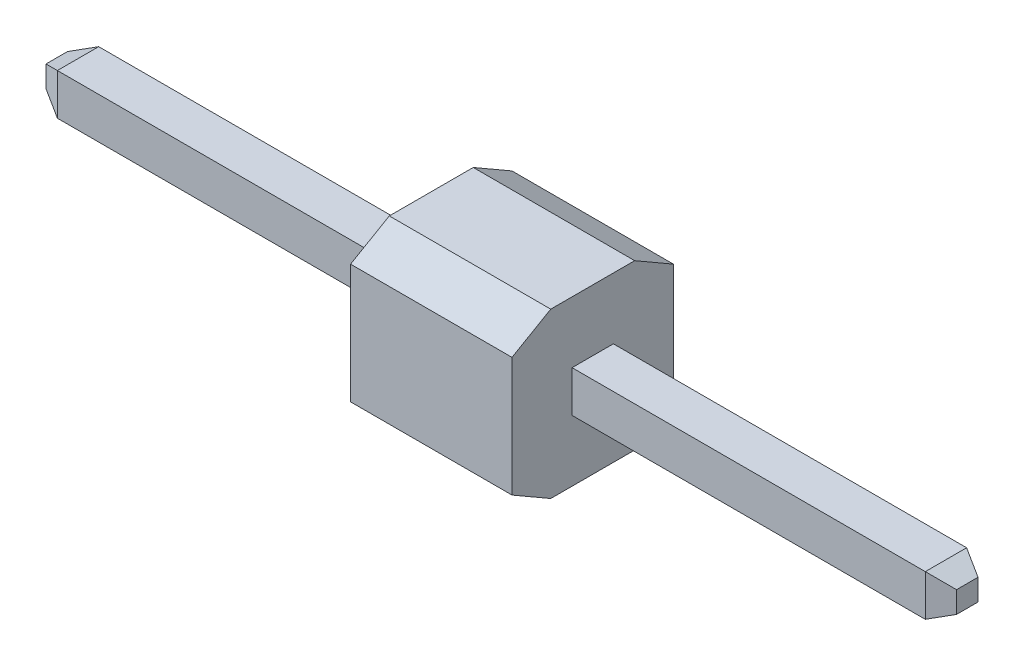
ISO-10303-21;
HEADER;
FILE_DESCRIPTION(('STEP AP214'),'2;1');
FILE_NAME('part.step','',(''),(''),'','','');
FILE_SCHEMA(('AUTOMOTIVE_DESIGN { 1 0 10303 214 1 1 1 1 }'));
ENDSEC;
DATA;
#1=APPLICATION_CONTEXT('core data for automotive mechanical design processes');
#2=APPLICATION_PROTOCOL_DEFINITION('international standard','automotive_design',2000,#1);
#3=PRODUCT_CONTEXT('',#1,'mechanical');
#4=PRODUCT('Part','Part','',(#3));
#5=PRODUCT_RELATED_PRODUCT_CATEGORY('part','',(#4));
#6=PRODUCT_DEFINITION_FORMATION('','',#4);
#7=PRODUCT_DEFINITION_CONTEXT('part definition',#1,'design');
#8=PRODUCT_DEFINITION('design','',#6,#7);
#9=PRODUCT_DEFINITION_SHAPE('','',#8);
#10=(LENGTH_UNIT() NAMED_UNIT(*) SI_UNIT(.MILLI.,.METRE.));
#11=(NAMED_UNIT(*) PLANE_ANGLE_UNIT() SI_UNIT($,.RADIAN.));
#12=(NAMED_UNIT(*) SI_UNIT($,.STERADIAN.) SOLID_ANGLE_UNIT());
#13=UNCERTAINTY_MEASURE_WITH_UNIT(LENGTH_MEASURE(1.E-05),#10,'distance_accuracy_value','');
#14=(GEOMETRIC_REPRESENTATION_CONTEXT(3) GLOBAL_UNCERTAINTY_ASSIGNED_CONTEXT((#13)) GLOBAL_UNIT_ASSIGNED_CONTEXT((#10,
#11,#12)) REPRESENTATION_CONTEXT('',''));
#15=CARTESIAN_POINT('',(0.,0.,0.));
#16=DIRECTION('',(0.,0.,1.));
#17=DIRECTION('',(1.,0.,0.));
#18=AXIS2_PLACEMENT_3D('',#15,#16,#17);
#19=CARTESIAN_POINT('',(5.42107640915581,7.93711572605714,-2.77112126172632));
#20=DIRECTION('',(1.,-9.93476518829084E-08,4.37113882867379E-08));
#21=DIRECTION('',(-9.93476589883358E-08,-1.,8.74227765734759E-08));
#22=AXIS2_PLACEMENT_3D('',#19,#20,#21);
#23=PLANE('',#22);
#24=DIRECTION('',(-1.18186632779335E-08,-0.50000007571054,-0.866025360072934));
#25=VECTOR('',#24,1.);
#26=CARTESIAN_POINT('',(5.4210762169812,6.69352602482091,-1.20112115300825));
#27=LINE('',#26,#25);
#28=CARTESIAN_POINT('',(5.4210762169812,6.69352602482091,-1.20112115300825));
#29=VERTEX_POINT('',#28);
#30=CARTESIAN_POINT('',(5.42107620879299,6.34711581085724,-1.80112112272411));
#31=VERTEX_POINT('',#30);
#32=EDGE_CURVE('E11',#29,#31,#27,.T.);
#33=ORIENTED_EDGE('',*,*,#32,.T.);
#34=DIRECTION('',(4.37113811813104E-08,-8.74227842254741E-08,-0.999999999999995));
#35=VECTOR('',#34,1.);
#36=CARTESIAN_POINT('',(5.42107620879299,6.34711581085724,-1.80112112272411));
#37=LINE('',#36,#35);
#38=CARTESIAN_POINT('',(5.42107626561779,6.34711569720762,-3.10112112272411));
#39=VERTEX_POINT('',#38);
#40=EDGE_CURVE('E304',#31,#39,#37,.T.);
#41=ORIENTED_EDGE('',*,*,#40,.T.);
#42=DIRECTION('',(8.75289963531793E-08,0.499999924289839,-0.866025447495712));
#43=VECTOR('',#42,1.);
#44=CARTESIAN_POINT('',(5.42107626561779,6.34711569720762,-3.10112112272411));
#45=LINE('',#44,#43);
#46=CARTESIAN_POINT('',(5.42107632625965,6.69352580626395,-3.70112115300825));
#47=VERTEX_POINT('',#46);
#48=EDGE_CURVE('E296',#39,#47,#45,.T.);
#49=ORIENTED_EDGE('',*,*,#48,.T.);
#50=DIRECTION('',(9.93476588436476E-08,0.999999999999991,-8.74227764822786E-08));
#51=VECTOR('',#50,1.);
#52=CARTESIAN_POINT('',(5.42107632625965,6.69352580626395,-3.70112115300825));
#53=LINE('',#52,#51);
#54=CARTESIAN_POINT('',(5.42107650977263,8.54070548323395,-3.70112131449382));
#55=VERTEX_POINT('',#54);
#56=EDGE_CURVE('E281',#47,#55,#53,.T.);
#57=ORIENTED_EDGE('',*,*,#56,.T.);
#58=DIRECTION('',(-1.18186632778483E-08,-0.500000075710534,-0.866025360072937));
#59=VECTOR('',#58,1.);
#60=CARTESIAN_POINT('',(5.42107651796084,8.88711569720762,-3.10112134477796));
#61=LINE('',#60,#59);
#62=CARTESIAN_POINT('',(5.42107651796084,8.88711569720762,-3.10112134477796));
#63=VERTEX_POINT('',#62);
#64=EDGE_CURVE('E265',#63,#55,#61,.T.);
#65=ORIENTED_EDGE('',*,*,#64,.F.);
#66=DIRECTION('',(4.37113811813104E-08,-8.74227842254741E-08,-0.999999999999995));
#67=VECTOR('',#66,1.);
#68=CARTESIAN_POINT('',(5.42107646113604,8.88711581085724,-1.80112134477796));
#69=LINE('',#68,#67);
#70=CARTESIAN_POINT('',(5.42107646113604,8.88711581085724,-1.80112134477796));
#71=VERTEX_POINT('',#70);
#72=EDGE_CURVE('E248',#71,#63,#69,.T.);
#73=ORIENTED_EDGE('',*,*,#72,.F.);
#74=DIRECTION('',(8.75289963525481E-08,0.499999924289833,-0.866025447495715));
#75=VECTOR('',#74,1.);
#76=CARTESIAN_POINT('',(5.42107640049418,8.54070570179091,-1.20112131449382));
#77=LINE('',#76,#75);
#78=CARTESIAN_POINT('',(5.42107640049418,8.54070570179091,-1.20112131449382));
#79=VERTEX_POINT('',#78);
#80=EDGE_CURVE('E242',#79,#71,#77,.T.);
#81=ORIENTED_EDGE('',*,*,#80,.F.);
#82=DIRECTION('',(9.93476588436476E-08,0.999999999999991,-8.74227762418639E-08));
#83=VECTOR('',#82,1.);
#84=CARTESIAN_POINT('',(5.4210762169812,6.69352602482091,-1.20112115300825));
#85=LINE('',#84,#83);
#86=EDGE_CURVE('E236',#29,#79,#85,.T.);
#87=ORIENTED_EDGE('',*,*,#86,.F.);
#88=EDGE_LOOP('',(#33,#41,#49,#57,#65,#73,#81,#87));
#89=FACE_BOUND('',#88,.T.);
#90=DIRECTION('',(-4.37113817364219E-08,8.74227856773042E-08,0.999999999999995));
#91=VECTOR('',#90,1.);
#92=CARTESIAN_POINT('',(5.42107634557331,7.29711572605714,-2.77112120577575));
#93=LINE('',#92,#91);
#94=CARTESIAN_POINT('',(5.42107634557331,7.29711572605714,-2.77112120577575));
#95=VERTEX_POINT('',#94);
#96=CARTESIAN_POINT('',(5.42107631759802,7.29711578200772,-2.13112120577575));
#97=VERTEX_POINT('',#96);
#98=EDGE_CURVE('E302',#95,#97,#93,.T.);
#99=ORIENTED_EDGE('',*,*,#98,.T.);
#100=DIRECTION('',(-9.93476592658906E-08,-0.999999999999991,8.74227766567418E-08));
#101=VECTOR('',#100,1.);
#102=CARTESIAN_POINT('',(5.42107638118052,7.93711578200772,-2.13112126172632));
#103=LINE('',#102,#101);
#104=CARTESIAN_POINT('',(5.42107638118052,7.93711578200772,-2.13112126172632));
#105=VERTEX_POINT('',#104);
#106=EDGE_CURVE('E293',#105,#97,#103,.T.);
#107=ORIENTED_EDGE('',*,*,#106,.F.);
#108=DIRECTION('',(-4.37113803486431E-08,8.74227856773043E-08,0.999999999999995));
#109=VECTOR('',#108,1.);
#110=CARTESIAN_POINT('',(5.42107640915581,7.93711572605714,-2.77112126172632));
#111=LINE('',#110,#109);
#112=CARTESIAN_POINT('',(5.42107640915581,7.93711572605714,-2.77112126172632));
#113=VERTEX_POINT('',#112);
#114=EDGE_CURVE('E278',#113,#105,#111,.T.);
#115=ORIENTED_EDGE('',*,*,#114,.F.);
#116=DIRECTION('',(-9.93476578781118E-08,-0.999999999999991,8.74227759628524E-08));
#117=VECTOR('',#116,1.);
#118=CARTESIAN_POINT('',(5.42107640915581,7.93711572605714,-2.77112126172632));
#119=LINE('',#118,#117);
#120=EDGE_CURVE('E263',#113,#95,#119,.T.);
#121=ORIENTED_EDGE('',*,*,#120,.T.);
#122=EDGE_LOOP('',(#99,#107,#115,#121));
#123=FACE_BOUND('',#122,.T.);
#124=ADVANCED_FACE('F17',(#89,#123),#23,.T.);
#125=CARTESIAN_POINT('',(2.92107640915581,7.93711597442627,-2.77112137100479));
#126=DIRECTION('',(1.,-9.93476518829084E-08,4.37113882867379E-08));
#127=DIRECTION('',(-9.93476589883358E-08,-1.,8.74227765734759E-08));
#128=AXIS2_PLACEMENT_3D('',#125,#126,#127);
#129=PLANE('',#128);
#130=DIRECTION('',(-1.1818662636946E-08,-0.50000007571054,-0.866025360072934));
#131=VECTOR('',#130,1.);
#132=CARTESIAN_POINT('',(2.9210762169812,6.69352627319004,-1.20112126228672));
#133=LINE('',#132,#131);
#134=CARTESIAN_POINT('',(2.9210762169812,6.69352627319004,-1.20112126228672));
#135=VERTEX_POINT('',#134);
#136=CARTESIAN_POINT('',(2.92107620879299,6.34711605922637,-1.80112123200258));
#137=VERTEX_POINT('',#136);
#138=EDGE_CURVE('E24',#135,#137,#133,.T.);
#139=ORIENTED_EDGE('',*,*,#138,.F.);
#140=DIRECTION('',(9.93476590840623E-08,0.999999999999991,-8.74227762418639E-08));
#141=VECTOR('',#140,1.);
#142=CARTESIAN_POINT('',(2.9210762169812,6.69352627319004,-1.20112126228672));
#143=LINE('',#142,#141);
#144=CARTESIAN_POINT('',(2.92107640049418,8.54070595016004,-1.20112142377229));
#145=VERTEX_POINT('',#144);
#146=EDGE_CURVE('E300',#135,#145,#143,.T.);
#147=ORIENTED_EDGE('',*,*,#146,.T.);
#148=DIRECTION('',(8.75289957115606E-08,0.499999924289833,-0.866025447495715));
#149=VECTOR('',#148,1.);
#150=CARTESIAN_POINT('',(2.92107640049418,8.54070595016004,-1.20112142377229));
#151=LINE('',#150,#149);
#152=CARTESIAN_POINT('',(2.92107646113604,8.88711605922637,-1.80112145405643));
#153=VERTEX_POINT('',#152);
#154=EDGE_CURVE('E286',#145,#153,#151,.T.);
#155=ORIENTED_EDGE('',*,*,#154,.T.);
#156=DIRECTION('',(4.37113811813104E-08,-8.74227842254741E-08,-0.999999999999995));
#157=VECTOR('',#156,1.);
#158=CARTESIAN_POINT('',(2.92107646113604,8.88711605922637,-1.80112145405643));
#159=LINE('',#158,#157);
#160=CARTESIAN_POINT('',(2.92107651796084,8.88711594557675,-3.10112145405643));
#161=VERTEX_POINT('',#160);
#162=EDGE_CURVE('E271',#153,#161,#159,.T.);
#163=ORIENTED_EDGE('',*,*,#162,.T.);
#164=DIRECTION('',(-1.18186626368607E-08,-0.500000075710534,-0.866025360072937));
#165=VECTOR('',#164,1.);
#166=CARTESIAN_POINT('',(2.92107651796084,8.88711594557675,-3.10112145405643));
#167=LINE('',#166,#165);
#168=CARTESIAN_POINT('',(2.92107650977263,8.54070573160308,-3.70112142377229));
#169=VERTEX_POINT('',#168);
#170=EDGE_CURVE('E253',#161,#169,#167,.T.);
#171=ORIENTED_EDGE('',*,*,#170,.T.);
#172=DIRECTION('',(9.93476590840623E-08,0.999999999999991,-8.74227764822786E-08));
#173=VECTOR('',#172,1.);
#174=CARTESIAN_POINT('',(2.92107632625965,6.69352605463308,-3.70112126228672));
#175=LINE('',#174,#173);
#176=CARTESIAN_POINT('',(2.92107632625965,6.69352605463308,-3.70112126228672));
#177=VERTEX_POINT('',#176);
#178=EDGE_CURVE('E261',#177,#169,#175,.T.);
#179=ORIENTED_EDGE('',*,*,#178,.F.);
#180=DIRECTION('',(8.75289957121918E-08,0.499999924289839,-0.866025447495712));
#181=VECTOR('',#180,1.);
#182=CARTESIAN_POINT('',(2.92107626561779,6.34711594557675,-3.10112123200258));
#183=LINE('',#182,#181);
#184=CARTESIAN_POINT('',(2.92107626561779,6.34711594557675,-3.10112123200258));
#185=VERTEX_POINT('',#184);
#186=EDGE_CURVE('E276',#185,#177,#183,.T.);
#187=ORIENTED_EDGE('',*,*,#186,.F.);
#188=DIRECTION('',(4.37113811813104E-08,-8.74227842254741E-08,-0.999999999999995));
#189=VECTOR('',#188,1.);
#190=CARTESIAN_POINT('',(2.92107620879299,6.34711605922637,-1.80112123200258));
#191=LINE('',#190,#189);
#192=EDGE_CURVE('E291',#137,#185,#191,.T.);
#193=ORIENTED_EDGE('',*,*,#192,.F.);
#194=EDGE_LOOP('',(#139,#147,#155,#163,#171,#179,#187,#193));
#195=FACE_BOUND('',#194,.T.);
#196=DIRECTION('',(-9.93476592658906E-08,-0.999999999999991,8.74227766567418E-08));
#197=VECTOR('',#196,1.);
#198=CARTESIAN_POINT('',(2.92107638118052,7.93711603037685,-2.13112137100479));
#199=LINE('',#198,#197);
#200=CARTESIAN_POINT('',(2.92107638118052,7.93711603037685,-2.13112137100479));
#201=VERTEX_POINT('',#200);
#202=CARTESIAN_POINT('',(2.92107631759802,7.29711603037685,-2.13112131505422));
#203=VERTEX_POINT('',#202);
#204=EDGE_CURVE('E298',#201,#203,#199,.T.);
#205=ORIENTED_EDGE('',*,*,#204,.T.);
#206=DIRECTION('',(-4.37113810425325E-08,8.74227856773042E-08,0.999999999999995));
#207=VECTOR('',#206,1.);
#208=CARTESIAN_POINT('',(2.92107634557331,7.29711597442627,-2.77112131505422));
#209=LINE('',#208,#207);
#210=CARTESIAN_POINT('',(2.92107634557331,7.29711597442627,-2.77112131505422));
#211=VERTEX_POINT('',#210);
#212=EDGE_CURVE('E283',#211,#203,#209,.T.);
#213=ORIENTED_EDGE('',*,*,#212,.F.);
#214=DIRECTION('',(-9.93476592658906E-08,-0.999999999999991,8.74227759628524E-08));
#215=VECTOR('',#214,1.);
#216=CARTESIAN_POINT('',(2.92107640915581,7.93711597442627,-2.77112137100479));
#217=LINE('',#216,#215);
#218=CARTESIAN_POINT('',(2.92107640915581,7.93711597442627,-2.77112137100479));
#219=VERTEX_POINT('',#218);
#220=EDGE_CURVE('E268',#219,#211,#217,.T.);
#221=ORIENTED_EDGE('',*,*,#220,.F.);
#222=DIRECTION('',(-4.37113810425325E-08,8.74227856773043E-08,0.999999999999995));
#223=VECTOR('',#222,1.);
#224=CARTESIAN_POINT('',(2.92107640915581,7.93711597442627,-2.77112137100479));
#225=LINE('',#224,#223);
#226=EDGE_CURVE('E251',#219,#201,#225,.T.);
#227=ORIENTED_EDGE('',*,*,#226,.T.);
#228=EDGE_LOOP('',(#205,#213,#221,#227));
#229=FACE_BOUND('',#228,.T.);
#230=ADVANCED_FACE('F314',(#195,#229),#129,.F.);
#231=CARTESIAN_POINT('',(5.4210762169812,6.69352602482091,-1.20112115300825));
#232=DIRECTION('',(1.07893287081065E-07,0.866025360072937,-0.500000075710535));
#233=DIRECTION('',(1.18186629566715E-08,0.500000075710542,0.866025360072941));
#234=AXIS2_PLACEMENT_3D('',#231,#232,#233);
#235=PLANE('',#234);
#236=ORIENTED_EDGE('',*,*,#138,.T.);
#237=DIRECTION('',(-0.999999999999994,9.93476533039933E-08,-4.37113882867377E-08));
#238=VECTOR('',#237,1.);
#239=CARTESIAN_POINT('',(5.42107620879299,6.34711581085724,-1.80112112272411));
#240=LINE('',#239,#238);
#241=EDGE_CURVE('E288',#31,#137,#240,.T.);
#242=ORIENTED_EDGE('',*,*,#241,.F.);
#243=ORIENTED_EDGE('',*,*,#32,.F.);
#244=DIRECTION('',(-0.999999999999994,9.93476504618223E-08,-4.3711388109102E-08));
#245=VECTOR('',#244,1.);
#246=CARTESIAN_POINT('',(5.4210762169812,6.69352602482091,-1.20112115300825));
#247=LINE('',#246,#245);
#248=EDGE_CURVE('E256',#29,#135,#247,.T.);
#249=ORIENTED_EDGE('',*,*,#248,.T.);
#250=EDGE_LOOP('',(#236,#242,#243,#249));
#251=FACE_BOUND('',#250,.T.);
#252=ADVANCED_FACE('F306',(#251),#235,.F.);
#253=CARTESIAN_POINT('',(5.42107620879299,6.34711581085724,-1.80112112272411));
#254=DIRECTION('',(9.93476589883358E-08,1.,-8.74227765734759E-08));
#255=DIRECTION('',(1.,-9.93476518829084E-08,4.37113882867379E-08));
#256=AXIS2_PLACEMENT_3D('',#253,#254,#255);
#257=PLANE('',#256);
#258=ORIENTED_EDGE('',*,*,#192,.T.);
#259=DIRECTION('',(-0.999999999999994,9.93476533039933E-08,-4.37113882867377E-08));
#260=VECTOR('',#259,1.);
#261=CARTESIAN_POINT('',(5.42107626561779,6.34711569720762,-3.10112112272411));
#262=LINE('',#261,#260);
#263=EDGE_CURVE('E273',#39,#185,#262,.T.);
#264=ORIENTED_EDGE('',*,*,#263,.F.);
#265=ORIENTED_EDGE('',*,*,#40,.F.);
#266=ORIENTED_EDGE('',*,*,#241,.T.);
#267=EDGE_LOOP('',(#258,#264,#265,#266));
#268=FACE_BOUND('',#267,.T.);
#269=ADVANCED_FACE('F311',(#268),#257,.F.);
#270=CARTESIAN_POINT('',(5.42107626561779,6.34711569720762,-3.10112112272411));
#271=DIRECTION('',(6.41819058997377E-08,0.866025447495721,0.499999924289845));
#272=DIRECTION('',(-8.7528996031702E-08,-0.499999924289838,0.866025447495717));
#273=AXIS2_PLACEMENT_3D('',#270,#271,#272);
#274=PLANE('',#273);
#275=ORIENTED_EDGE('',*,*,#186,.T.);
#276=DIRECTION('',(-0.999999999999994,9.93476504618223E-08,-4.37113882867377E-08));
#277=VECTOR('',#276,1.);
#278=CARTESIAN_POINT('',(5.42107632625965,6.69352580626395,-3.70112115300825));
#279=LINE('',#278,#277);
#280=EDGE_CURVE('E258',#47,#177,#279,.T.);
#281=ORIENTED_EDGE('',*,*,#280,.F.);
#282=ORIENTED_EDGE('',*,*,#48,.F.);
#283=ORIENTED_EDGE('',*,*,#263,.T.);
#284=EDGE_LOOP('',(#275,#281,#282,#283));
#285=FACE_BOUND('',#284,.T.);
#286=ADVANCED_FACE('F319',(#285),#274,.F.);
#287=CARTESIAN_POINT('',(5.42107632625965,6.69352580626395,-3.70112115300825));
#288=DIRECTION('',(-4.37113811813106E-08,8.74227836789032E-08,1.));
#289=DIRECTION('',(-1.,9.93476518829084E-08,-4.37113882867379E-08));
#290=AXIS2_PLACEMENT_3D('',#287,#288,#289);
#291=PLANE('',#290);
#292=ORIENTED_EDGE('',*,*,#178,.T.);
#293=DIRECTION('',(-0.999999999999994,9.93476504618223E-08,-4.37113882867377E-08));
#294=VECTOR('',#293,1.);
#295=CARTESIAN_POINT('',(5.42107650977263,8.54070548323395,-3.70112131449382));
#296=LINE('',#295,#294);
#297=EDGE_CURVE('E245',#55,#169,#296,.T.);
#298=ORIENTED_EDGE('',*,*,#297,.F.);
#299=ORIENTED_EDGE('',*,*,#56,.F.);
#300=ORIENTED_EDGE('',*,*,#280,.T.);
#301=EDGE_LOOP('',(#292,#298,#299,#300));
#302=FACE_BOUND('',#301,.T.);
#303=ADVANCED_FACE('F326',(#302),#291,.F.);
#304=CARTESIAN_POINT('',(5.42107651796084,8.88711569720762,-3.10112134477796));
#305=DIRECTION('',(1.07893287081065E-07,0.866025360072937,-0.500000075710535));
#306=DIRECTION('',(1.18186629566715E-08,0.500000075710542,0.866025360072941));
#307=AXIS2_PLACEMENT_3D('',#304,#305,#306);
#308=PLANE('',#307);
#309=ORIENTED_EDGE('',*,*,#170,.F.);
#310=DIRECTION('',(-0.999999999999994,9.93476504618223E-08,-4.37113882867377E-08));
#311=VECTOR('',#310,1.);
#312=CARTESIAN_POINT('',(5.42107651796084,8.88711569720762,-3.10112134477796));
#313=LINE('',#312,#311);
#314=EDGE_CURVE('E239',#63,#161,#313,.T.);
#315=ORIENTED_EDGE('',*,*,#314,.F.);
#316=ORIENTED_EDGE('',*,*,#64,.T.);
#317=ORIENTED_EDGE('',*,*,#297,.T.);
#318=EDGE_LOOP('',(#309,#315,#316,#317));
#319=FACE_BOUND('',#318,.T.);
#320=ADVANCED_FACE('F329',(#319),#308,.T.);
#321=CARTESIAN_POINT('',(5.42107646113604,8.88711581085724,-1.80112134477796));
#322=DIRECTION('',(9.93476589883358E-08,1.,-8.74227765734759E-08));
#323=DIRECTION('',(1.,-9.93476518829084E-08,4.37113882867379E-08));
#324=AXIS2_PLACEMENT_3D('',#321,#322,#323);
#325=PLANE('',#324);
#326=ORIENTED_EDGE('',*,*,#162,.F.);
#327=DIRECTION('',(-0.999999999999994,9.93476504618223E-08,-4.37113884643734E-08));
#328=VECTOR('',#327,1.);
#329=CARTESIAN_POINT('',(5.42107646113604,8.88711581085724,-1.80112134477796));
#330=LINE('',#329,#328);
#331=EDGE_CURVE('E233',#71,#153,#330,.T.);
#332=ORIENTED_EDGE('',*,*,#331,.F.);
#333=ORIENTED_EDGE('',*,*,#72,.T.);
#334=ORIENTED_EDGE('',*,*,#314,.T.);
#335=EDGE_LOOP('',(#326,#332,#333,#334));
#336=FACE_BOUND('',#335,.T.);
#337=ADVANCED_FACE('F333',(#336),#325,.T.);
#338=CARTESIAN_POINT('',(5.42107640049418,8.54070570179091,-1.20112131449382));
#339=DIRECTION('',(6.41819058997377E-08,0.866025447495721,0.499999924289845));
#340=DIRECTION('',(-8.7528996031702E-08,-0.499999924289838,0.866025447495717));
#341=AXIS2_PLACEMENT_3D('',#338,#339,#340);
#342=PLANE('',#341);
#343=ORIENTED_EDGE('',*,*,#154,.F.);
#344=DIRECTION('',(-0.999999999999994,9.93476504618223E-08,-4.3711388109102E-08));
#345=VECTOR('',#344,1.);
#346=CARTESIAN_POINT('',(5.42107640049418,8.54070570179091,-1.20112131449382));
#347=LINE('',#346,#345);
#348=EDGE_CURVE('E230',#79,#145,#347,.T.);
#349=ORIENTED_EDGE('',*,*,#348,.F.);
#350=ORIENTED_EDGE('',*,*,#80,.T.);
#351=ORIENTED_EDGE('',*,*,#331,.T.);
#352=EDGE_LOOP('',(#343,#349,#350,#351));
#353=FACE_BOUND('',#352,.T.);
#354=ADVANCED_FACE('F337',(#353),#342,.T.);
#355=CARTESIAN_POINT('',(5.4210762169812,6.69352602482091,-1.20112115300825));
#356=DIRECTION('',(-4.37113811813106E-08,8.74227835615132E-08,1.));
#357=DIRECTION('',(-9.93476589883358E-08,-1.,8.74227764560859E-08));
#358=AXIS2_PLACEMENT_3D('',#355,#356,#357);
#359=PLANE('',#358);
#360=ORIENTED_EDGE('',*,*,#146,.F.);
#361=ORIENTED_EDGE('',*,*,#248,.F.);
#362=ORIENTED_EDGE('',*,*,#86,.T.);
#363=ORIENTED_EDGE('',*,*,#348,.T.);
#364=EDGE_LOOP('',(#360,#361,#362,#363));
#365=FACE_BOUND('',#364,.T.);
#366=ADVANCED_FACE('F339',(#365),#359,.T.);
#367=CARTESIAN_POINT('',(-2.87892359084419,7.93711655064265,-2.77112162453085));
#368=DIRECTION('',(-1.,9.93476518829084E-08,-4.37113882867379E-08));
#369=DIRECTION('',(9.93476589883358E-08,1.,-8.74227765734759E-08));
#370=AXIS2_PLACEMENT_3D('',#367,#368,#369);
#371=PLANE('',#370);
#372=DIRECTION('',(9.93476634944484E-08,0.999999999999991,-8.7422776141512E-08));
#373=VECTOR('',#372,1.);
#374=CARTESIAN_POINT('',(-2.87892366038784,7.45099812033048,-2.28500310922402));
#375=LINE('',#374,#373);
#376=CARTESIAN_POINT('',(-2.87892366038783,7.45099812033048,-2.28500310922402));
#377=VERTEX_POINT('',#376);
#378=CARTESIAN_POINT('',(-2.87892362738087,7.78323506594048,-2.2850031382691));
#379=VERTEX_POINT('',#378);
#380=EDGE_CURVE('E228',#377,#379,#375,.T.);
#381=ORIENTED_EDGE('',*,*,#380,.T.);
#382=DIRECTION('',(4.37113793813867E-08,-8.74227854960561E-08,-0.999999999999995));
#383=VECTOR('',#382,1.);
#384=CARTESIAN_POINT('',(-2.87892362738087,7.78323506594048,-2.2850031382691));
#385=LINE('',#384,#383);
#386=CARTESIAN_POINT('',(-2.87892361285834,7.7832350368954,-2.6172400838871));
#387=VERTEX_POINT('',#386);
#388=EDGE_CURVE('E223',#379,#387,#385,.T.);
#389=ORIENTED_EDGE('',*,*,#388,.T.);
#390=DIRECTION('',(-9.93476608211201E-08,-0.999999999999991,8.7422776141512E-08));
#391=VECTOR('',#390,1.);
#392=CARTESIAN_POINT('',(-2.87892361285834,7.7832350368954,-2.6172400838871));
#393=LINE('',#392,#391);
#394=CARTESIAN_POINT('',(-2.8789236458653,7.4509980912854,-2.61724005484202));
#395=VERTEX_POINT('',#394);
#396=EDGE_CURVE('E215',#387,#395,#393,.T.);
#397=ORIENTED_EDGE('',*,*,#396,.T.);
#398=DIRECTION('',(-4.37113767080584E-08,8.7422774802743E-08,0.999999999999995));
#399=VECTOR('',#398,1.);
#400=CARTESIAN_POINT('',(-2.8789236458653,7.4509980912854,-2.61724005484202));
#401=LINE('',#400,#399);
#402=EDGE_CURVE('E207',#395,#377,#401,.T.);
#403=ORIENTED_EDGE('',*,*,#402,.T.);
#404=EDGE_LOOP('',(#381,#389,#397,#403));
#405=FACE_BOUND('',#404,.T.);
#406=ADVANCED_FACE('F341',(#405),#371,.T.);
#407=CARTESIAN_POINT('',(-2.87892359084419,7.93711655064265,-2.77112162453085));
#408=DIRECTION('',(9.93476589883358E-08,1.,-8.74227764510112E-08));
#409=DIRECTION('',(-4.37113811813106E-08,8.74227835564385E-08,1.));
#410=AXIS2_PLACEMENT_3D('',#407,#408,#409);
#411=PLANE('',#410);
#412=DIRECTION('',(0.999999999999994,-9.93476534027159E-08,4.37113883581816E-08));
#413=VECTOR('',#412,1.);
#414=CARTESIAN_POINT('',(-2.54892359084419,7.93711651785793,-2.77112161010609));
#415=LINE('',#414,#413);
#416=CARTESIAN_POINT('',(-2.54892359084419,7.93711651785793,-2.77112161010609));
#417=VERTEX_POINT('',#416);
#418=EDGE_CURVE('E225',#417,#219,#415,.T.);
#419=ORIENTED_EDGE('',*,*,#418,.F.);
#420=DIRECTION('',(-4.37113803486431E-08,8.74227856773042E-08,0.999999999999995));
#421=VECTOR('',#420,1.);
#422=CARTESIAN_POINT('',(-2.54892359084419,7.93711651785793,-2.77112161010609));
#423=LINE('',#422,#421);
#424=CARTESIAN_POINT('',(-2.54892361881948,7.93711657380851,-2.13112161010609));
#425=VERTEX_POINT('',#424);
#426=EDGE_CURVE('E217',#417,#425,#423,.T.);
#427=ORIENTED_EDGE('',*,*,#426,.T.);
#428=DIRECTION('',(0.999999999999994,-9.93476534027159E-08,4.3711388195809E-08));
#429=VECTOR('',#428,1.);
#430=CARTESIAN_POINT('',(-2.54892361881948,7.93711657380851,-2.13112161010609));
#431=LINE('',#430,#429);
#432=EDGE_CURVE('E220',#425,#201,#431,.T.);
#433=ORIENTED_EDGE('',*,*,#432,.T.);
#434=ORIENTED_EDGE('',*,*,#226,.F.);
#435=EDGE_LOOP('',(#419,#427,#433,#434));
#436=FACE_BOUND('',#435,.T.);
#437=ADVANCED_FACE('F348',(#436),#411,.T.);
#438=CARTESIAN_POINT('',(-2.87892361881948,7.93711660659323,-2.13112162453085));
#439=DIRECTION('',(-4.37113811813106E-08,8.74227836789032E-08,1.));
#440=DIRECTION('',(-1.,9.93476518829084E-08,-4.37113882867379E-08));
#441=AXIS2_PLACEMENT_3D('',#438,#439,#440);
#442=PLANE('',#441);
#443=ORIENTED_EDGE('',*,*,#432,.F.);
#444=DIRECTION('',(-9.93476592658906E-08,-0.999999999999991,8.74227766567418E-08));
#445=VECTOR('',#444,1.);
#446=CARTESIAN_POINT('',(-2.54892361881948,7.93711657380851,-2.13112161010609));
#447=LINE('',#446,#445);
#448=CARTESIAN_POINT('',(-2.54892368240198,7.29711657380851,-2.13112155415551));
#449=VERTEX_POINT('',#448);
#450=EDGE_CURVE('E209',#425,#449,#447,.T.);
#451=ORIENTED_EDGE('',*,*,#450,.T.);
#452=DIRECTION('',(0.999999999999994,-9.93476534027159E-08,4.37113882769953E-08));
#453=VECTOR('',#452,1.);
#454=CARTESIAN_POINT('',(-2.54892368240198,7.29711657380851,-2.13112155415551));
#455=LINE('',#454,#453);
#456=EDGE_CURVE('E212',#449,#203,#455,.T.);
#457=ORIENTED_EDGE('',*,*,#456,.T.);
#458=ORIENTED_EDGE('',*,*,#204,.F.);
#459=EDGE_LOOP('',(#443,#451,#457,#458));
#460=FACE_BOUND('',#459,.T.);
#461=ADVANCED_FACE('F424',(#460),#442,.T.);
#462=CARTESIAN_POINT('',(-2.87892365442669,7.29711655064265,-2.77112156858027));
#463=DIRECTION('',(9.93476589883357E-08,1.,-8.74227764040693E-08));
#464=DIRECTION('',(-4.37113811813106E-08,8.74227835094966E-08,1.));
#465=AXIS2_PLACEMENT_3D('',#462,#463,#464);
#466=PLANE('',#465);
#467=ORIENTED_EDGE('',*,*,#456,.F.);
#468=DIRECTION('',(4.37113831242006E-08,-8.74227967795345E-08,-0.999999999999995));
#469=VECTOR('',#468,1.);
#470=CARTESIAN_POINT('',(-2.54892368240198,7.29711657380852,-2.13112155415551));
#471=LINE('',#470,#469);
#472=CARTESIAN_POINT('',(-2.54892365442669,7.29711651785793,-2.77112155415551));
#473=VERTEX_POINT('',#472);
#474=EDGE_CURVE('E201',#449,#473,#471,.T.);
#475=ORIENTED_EDGE('',*,*,#474,.T.);
#476=DIRECTION('',(0.999999999999994,-9.93476534027159E-08,4.37113882769953E-08));
#477=VECTOR('',#476,1.);
#478=CARTESIAN_POINT('',(-2.54892365442669,7.29711651785793,-2.77112155415551));
#479=LINE('',#478,#477);
#480=EDGE_CURVE('E204',#473,#211,#479,.T.);
#481=ORIENTED_EDGE('',*,*,#480,.T.);
#482=ORIENTED_EDGE('',*,*,#212,.T.);
#483=EDGE_LOOP('',(#467,#475,#481,#482));
#484=FACE_BOUND('',#483,.T.);
#485=ADVANCED_FACE('F421',(#484),#466,.F.);
#486=CARTESIAN_POINT('',(-2.87892359084419,7.93711655064265,-2.77112162453085));
#487=DIRECTION('',(-4.37113811813106E-08,8.74227836789032E-08,1.));
#488=DIRECTION('',(-1.,9.93476518829084E-08,-4.37113882867379E-08));
#489=AXIS2_PLACEMENT_3D('',#486,#487,#488);
#490=PLANE('',#489);
#491=ORIENTED_EDGE('',*,*,#480,.F.);
#492=DIRECTION('',(9.9347656490333E-08,0.999999999999991,-8.74227766567418E-08));
#493=VECTOR('',#492,1.);
#494=CARTESIAN_POINT('',(-2.54892365442669,7.29711651785793,-2.77112155415551));
#495=LINE('',#494,#493);
#496=EDGE_CURVE('E196',#473,#417,#495,.T.);
#497=ORIENTED_EDGE('',*,*,#496,.T.);
#498=ORIENTED_EDGE('',*,*,#418,.T.);
#499=ORIENTED_EDGE('',*,*,#220,.T.);
#500=EDGE_LOOP('',(#491,#497,#498,#499));
#501=FACE_BOUND('',#500,.T.);
#502=ADVANCED_FACE('F376',(#501),#490,.F.);
#503=CARTESIAN_POINT('',(-2.87892359084419,7.93711655064265,-2.77112162453085));
#504=DIRECTION('',(-4.37113811813106E-08,8.74227836789032E-08,1.));
#505=DIRECTION('',(-1.,9.93476518829084E-08,-4.37113882867379E-08));
#506=AXIS2_PLACEMENT_3D('',#503,#504,#505);
#507=PLANE('',#506);
#508=DIRECTION('',(0.999999999999994,-9.93476521037346E-08,4.37113882769953E-08));
#509=VECTOR('',#508,1.);
#510=CARTESIAN_POINT('',(5.42107640915581,7.93711572605713,-2.77112126172632));
#511=LINE('',#510,#509);
#512=CARTESIAN_POINT('',(10.8910764091558,7.93711518262548,-2.77112102262503));
#513=VERTEX_POINT('',#512);
#514=EDGE_CURVE('E199',#113,#513,#511,.T.);
#515=ORIENTED_EDGE('',*,*,#514,.T.);
#516=DIRECTION('',(-9.93476606536693E-08,-0.999999999999991,8.74227766567418E-08));
#517=VECTOR('',#516,1.);
#518=CARTESIAN_POINT('',(10.8910764091558,7.93711518262548,-2.77112102262503));
#519=LINE('',#518,#517);
#520=CARTESIAN_POINT('',(10.8910763455733,7.29711518262548,-2.77112096667445));
#521=VERTEX_POINT('',#520);
#522=EDGE_CURVE('E191',#513,#521,#519,.T.);
#523=ORIENTED_EDGE('',*,*,#522,.T.);
#524=DIRECTION('',(0.999999999999994,-9.93476469078097E-08,4.37113883581817E-08));
#525=VECTOR('',#524,1.);
#526=CARTESIAN_POINT('',(5.42107634557331,7.29711572605715,-2.77112120577575));
#527=LINE('',#526,#525);
#528=EDGE_CURVE('E194',#95,#521,#527,.T.);
#529=ORIENTED_EDGE('',*,*,#528,.F.);
#530=ORIENTED_EDGE('',*,*,#120,.F.);
#531=EDGE_LOOP('',(#515,#523,#529,#530));
#532=FACE_BOUND('',#531,.T.);
#533=ADVANCED_FACE('F367',(#532),#507,.F.);
#534=CARTESIAN_POINT('',(-2.87892365442669,7.29711655064265,-2.77112156858027));
#535=DIRECTION('',(9.93476589883357E-08,1.,-8.74227764040693E-08));
#536=DIRECTION('',(-4.37113811813106E-08,8.74227835094966E-08,1.));
#537=AXIS2_PLACEMENT_3D('',#534,#535,#536);
#538=PLANE('',#537);
#539=ORIENTED_EDGE('',*,*,#528,.T.);
#540=DIRECTION('',(-4.37113845119795E-08,8.74227856773043E-08,0.999999999999995));
#541=VECTOR('',#540,1.);
#542=CARTESIAN_POINT('',(10.8910763455733,7.29711518262548,-2.77112096667445));
#543=LINE('',#542,#541);
#544=CARTESIAN_POINT('',(10.891076317598,7.29711523857607,-2.13112096667445));
#545=VERTEX_POINT('',#544);
#546=EDGE_CURVE('E186',#521,#545,#543,.T.);
#547=ORIENTED_EDGE('',*,*,#546,.T.);
#548=DIRECTION('',(0.999999999999994,-9.93476469078097E-08,4.37113880334363E-08));
#549=VECTOR('',#548,1.);
#550=CARTESIAN_POINT('',(5.42107631759802,7.29711578200773,-2.13112120577575));
#551=LINE('',#550,#549);
#552=EDGE_CURVE('E189',#97,#545,#551,.T.);
#553=ORIENTED_EDGE('',*,*,#552,.F.);
#554=ORIENTED_EDGE('',*,*,#98,.F.);
#555=EDGE_LOOP('',(#539,#547,#553,#554));
#556=FACE_BOUND('',#555,.T.);
#557=ADVANCED_FACE('F364',(#556),#538,.F.);
#558=CARTESIAN_POINT('',(-2.87892361881948,7.93711660659323,-2.13112162453085));
#559=DIRECTION('',(-4.37113811813106E-08,8.74227836789032E-08,1.));
#560=DIRECTION('',(-1.,9.93476518829084E-08,-4.37113882867379E-08));
#561=AXIS2_PLACEMENT_3D('',#558,#559,#560);
#562=PLANE('',#561);
#563=ORIENTED_EDGE('',*,*,#552,.T.);
#564=DIRECTION('',(9.93476606536693E-08,0.999999999999991,-8.74227766567418E-08));
#565=VECTOR('',#564,1.);
#566=CARTESIAN_POINT('',(10.891076317598,7.29711523857607,-2.13112096667445));
#567=LINE('',#566,#565);
#568=CARTESIAN_POINT('',(10.8910763811805,7.93711523857607,-2.13112102262503));
#569=VERTEX_POINT('',#568);
#570=EDGE_CURVE('E176',#545,#569,#567,.T.);
#571=ORIENTED_EDGE('',*,*,#570,.T.);
#572=DIRECTION('',(0.999999999999994,-9.93476521037347E-08,4.3711388195809E-08));
#573=VECTOR('',#572,1.);
#574=CARTESIAN_POINT('',(5.42107638118052,7.93711578200772,-2.13112126172632));
#575=LINE('',#574,#573);
#576=EDGE_CURVE('E179',#105,#569,#575,.T.);
#577=ORIENTED_EDGE('',*,*,#576,.F.);
#578=ORIENTED_EDGE('',*,*,#106,.T.);
#579=EDGE_LOOP('',(#563,#571,#577,#578));
#580=FACE_BOUND('',#579,.T.);
#581=ADVANCED_FACE('F366',(#580),#562,.T.);
#582=CARTESIAN_POINT('',(-2.87892359084419,7.93711655064265,-2.77112162453085));
#583=DIRECTION('',(9.93476589883358E-08,1.,-8.74227764510112E-08));
#584=DIRECTION('',(-4.37113811813106E-08,8.74227835564385E-08,1.));
#585=AXIS2_PLACEMENT_3D('',#582,#583,#584);
#586=PLANE('',#585);
#587=ORIENTED_EDGE('',*,*,#576,.T.);
#588=DIRECTION('',(4.37113789608643E-08,-8.74227856773043E-08,-0.999999999999995));
#589=VECTOR('',#588,1.);
#590=CARTESIAN_POINT('',(10.8910763811805,7.93711523857607,-2.13112102262503));
#591=LINE('',#590,#589);
#592=EDGE_CURVE('E167',#569,#513,#591,.T.);
#593=ORIENTED_EDGE('',*,*,#592,.T.);
#594=ORIENTED_EDGE('',*,*,#514,.F.);
#595=ORIENTED_EDGE('',*,*,#114,.T.);
#596=EDGE_LOOP('',(#587,#593,#594,#595));
#597=FACE_BOUND('',#596,.T.);
#598=ADVANCED_FACE('F373',(#597),#586,.T.);
#599=CARTESIAN_POINT('',(11.2210764091558,7.93711514984076,-2.77112100820027));
#600=DIRECTION('',(-1.,9.93476518829084E-08,-4.37113882867379E-08));
#601=DIRECTION('',(9.93476589883358E-08,1.,-8.74227765734759E-08));
#602=AXIS2_PLACEMENT_3D('',#599,#600,#601);
#603=PLANE('',#602);
#604=DIRECTION('',(-9.93476581477919E-08,-0.999999999999991,8.7422776141512E-08));
#605=VECTOR('',#604,1.);
#606=CARTESIAN_POINT('',(11.2210763726191,7.78323366513859,-2.28500252193852));
#607=LINE('',#606,#605);
#608=CARTESIAN_POINT('',(11.2210763726191,7.78323366513859,-2.28500252193852));
#609=VERTEX_POINT('',#608);
#610=CARTESIAN_POINT('',(11.2210763396122,7.45099671952859,-2.28500249289345));
#611=VERTEX_POINT('',#610);
#612=EDGE_CURVE('E153',#609,#611,#607,.T.);
#613=ORIENTED_EDGE('',*,*,#612,.T.);
#614=DIRECTION('',(4.37113820547149E-08,-8.74227961893691E-08,-0.999999999999995));
#615=VECTOR('',#614,1.);
#616=CARTESIAN_POINT('',(11.2210763396122,7.4509967195286,-2.28500249289345));
#617=LINE('',#616,#615);
#618=CARTESIAN_POINT('',(11.2210763541347,7.45099669048351,-2.61723943851144));
#619=VERTEX_POINT('',#618);
#620=EDGE_CURVE('E395',#611,#619,#617,.T.);
#621=ORIENTED_EDGE('',*,*,#620,.T.);
#622=DIRECTION('',(9.93476581477919E-08,0.999999999999991,-8.74227774781761E-08));
#623=VECTOR('',#622,1.);
#624=CARTESIAN_POINT('',(11.2210763541347,7.45099669048351,-2.61723943851144));
#625=LINE('',#624,#623);
#626=CARTESIAN_POINT('',(11.2210763871417,7.78323363609351,-2.61723946755652));
#627=VERTEX_POINT('',#626);
#628=EDGE_CURVE('E156',#619,#627,#625,.T.);
#629=ORIENTED_EDGE('',*,*,#628,.T.);
#630=DIRECTION('',(-4.37113874013715E-08,8.74227854960561E-08,0.999999999999995));
#631=VECTOR('',#630,1.);
#632=CARTESIAN_POINT('',(11.2210763871417,7.78323363609351,-2.61723946755652));
#633=LINE('',#632,#631);
#634=EDGE_CURVE('E149',#627,#609,#633,.T.);
#635=ORIENTED_EDGE('',*,*,#634,.T.);
#636=EDGE_LOOP('',(#613,#621,#629,#635));
#637=FACE_BOUND('',#636,.T.);
#638=ADVANCED_FACE('F151',(#637),#603,.F.);
#639=CARTESIAN_POINT('',(-2.87892363913892,7.45099807783265,-2.77112158203302));
#640=DIRECTION('',(-0.422618351780369,-0.906307745050466,6.07587120833484E-08));
#641=DIRECTION('',(4.37113811813106E-08,-8.74227835094966E-08,-1.));
#642=AXIS2_PLACEMENT_3D('',#639,#640,#641);
#643=PLANE('',#642);
#644=DIRECTION('',(0.834817073788752,-0.389281669540032,0.3892816911581));
#645=VECTOR('',#644,1.);
#646=CARTESIAN_POINT('',(-2.87892366038785,7.45099812032996,-2.2850031092245));
#647=LINE('',#646,#645);
#648=EDGE_CURVE('E181',#377,#449,#647,.T.);
#649=ORIENTED_EDGE('',*,*,#648,.F.);
#650=ORIENTED_EDGE('',*,*,#402,.F.);
#651=DIRECTION('',(-0.834817107820827,0.389281737604197,0.389281550111904));
#652=VECTOR('',#651,1.);
#653=CARTESIAN_POINT('',(-2.54892365442712,7.29711651785646,-2.77112155415497));
#654=LINE('',#653,#652);
#655=EDGE_CURVE('E404',#473,#395,#654,.T.);
#656=ORIENTED_EDGE('',*,*,#655,.F.);
#657=ORIENTED_EDGE('',*,*,#474,.F.);
#658=EDGE_LOOP('',(#649,#650,#656,#657));
#659=FACE_BOUND('',#658,.T.);
#660=ADVANCED_FACE('F418',(#659),#643,.T.);
#661=CARTESIAN_POINT('',(-2.87892359757057,7.9371165640954,-2.61724009733985));
#662=DIRECTION('',(-0.422618222124847,-3.72458176658199E-08,-0.906307805509828));
#663=DIRECTION('',(9.93476589883358E-08,1.,-8.74227765734759E-08));
#664=AXIS2_PLACEMENT_3D('',#661,#662,#663);
#665=PLANE('',#664);
#666=ORIENTED_EDGE('',*,*,#655,.T.);
#667=ORIENTED_EDGE('',*,*,#396,.F.);
#668=DIRECTION('',(-0.834817185169254,-0.389281503665803,0.389281618176064));
#669=VECTOR('',#668,1.);
#670=CARTESIAN_POINT('',(-2.54892359084305,7.9371165178552,-2.77112161010636));
#671=LINE('',#670,#669);
#672=EDGE_CURVE('E160',#417,#387,#671,.T.);
#673=ORIENTED_EDGE('',*,*,#672,.F.);
#674=ORIENTED_EDGE('',*,*,#496,.F.);
#675=EDGE_LOOP('',(#666,#667,#673,#674));
#676=FACE_BOUND('',#675,.T.);
#677=ADVANCED_FACE('F434',(#676),#665,.T.);
#678=CARTESIAN_POINT('',(-2.54892361881948,7.93711657380851,-2.13112161010609));
#679=DIRECTION('',(0.422618301356777,-1.21218081559392E-07,-0.906307768563367));
#680=DIRECTION('',(-9.93476589883358E-08,-1.,8.74227765734759E-08));
#681=AXIS2_PLACEMENT_3D('',#678,#679,#680);
#682=PLANE('',#681);
#683=ORIENTED_EDGE('',*,*,#648,.T.);
#684=ORIENTED_EDGE('',*,*,#450,.F.);
#685=DIRECTION('',(0.834817151137179,0.38928157172997,0.389281623093934));
#686=VECTOR('',#685,1.);
#687=CARTESIAN_POINT('',(-2.87892362738371,7.78323506594802,-2.28500313827056));
#688=LINE('',#687,#686);
#689=EDGE_CURVE('E170',#379,#425,#688,.T.);
#690=ORIENTED_EDGE('',*,*,#689,.F.);
#691=ORIENTED_EDGE('',*,*,#380,.F.);
#692=EDGE_LOOP('',(#683,#684,#690,#691));
#693=FACE_BOUND('',#692,.T.);
#694=ADVANCED_FACE('F413',(#693),#682,.F.);
#695=CARTESIAN_POINT('',(-2.54892359084419,7.93711651785793,-2.77112161010609));
#696=DIRECTION('',(0.422618171701255,-0.906307829022729,9.770517399793E-08));
#697=DIRECTION('',(-4.37113811813106E-08,8.74227835564385E-08,1.));
#698=AXIS2_PLACEMENT_3D('',#695,#696,#697);
#699=PLANE('',#698);
#700=ORIENTED_EDGE('',*,*,#672,.T.);
#701=ORIENTED_EDGE('',*,*,#388,.F.);
#702=ORIENTED_EDGE('',*,*,#689,.T.);
#703=ORIENTED_EDGE('',*,*,#426,.F.);
#704=EDGE_LOOP('',(#700,#701,#702,#703));
#705=FACE_BOUND('',#704,.T.);
#706=ADVANCED_FACE('F429',(#705),#699,.F.);
#707=CARTESIAN_POINT('',(11.221076393868,7.78323362264076,-2.77112099474752));
#708=DIRECTION('',(0.422618351780369,0.906307745050466,-6.07587121258922E-08));
#709=DIRECTION('',(4.37113811813106E-08,-8.74227835564385E-08,-1.));
#710=AXIS2_PLACEMENT_3D('',#707,#708,#709);
#711=PLANE('',#710);
#712=DIRECTION('',(-0.834817107820824,0.389281737604203,0.389281550111906));
#713=VECTOR('',#712,1.);
#714=CARTESIAN_POINT('',(11.2210763726191,7.78323366513911,-2.285002521939));
#715=LINE('',#714,#713);
#716=EDGE_CURVE('E164',#609,#569,#715,.T.);
#717=ORIENTED_EDGE('',*,*,#716,.F.);
#718=ORIENTED_EDGE('',*,*,#634,.F.);
#719=DIRECTION('',(0.834817073788751,-0.389281669540036,0.389281691158099));
#720=VECTOR('',#719,1.);
#721=CARTESIAN_POINT('',(10.8910764091558,7.93711518262548,-2.77112102262503));
#722=LINE('',#721,#720);
#723=EDGE_CURVE('E392',#513,#627,#722,.T.);
#724=ORIENTED_EDGE('',*,*,#723,.F.);
#725=ORIENTED_EDGE('',*,*,#592,.F.);
#726=EDGE_LOOP('',(#717,#718,#724,#725));
#727=FACE_BOUND('',#726,.T.);
#728=ADVANCED_FACE('F165',(#727),#711,.T.);
#729=CARTESIAN_POINT('',(10.8910764091558,7.93711518262548,-2.77112102262503));
#730=DIRECTION('',(-0.422618301356777,1.21218081559392E-07,0.906307768563367));
#731=DIRECTION('',(-9.93476589883358E-08,-1.,8.74227765734759E-08));
#732=AXIS2_PLACEMENT_3D('',#729,#730,#731);
#733=PLANE('',#732);
#734=ORIENTED_EDGE('',*,*,#723,.T.);
#735=ORIENTED_EDGE('',*,*,#628,.F.);
#736=DIRECTION('',(0.834817151137177,0.389281571729974,0.389281623093935));
#737=VECTOR('',#736,1.);
#738=CARTESIAN_POINT('',(10.8910763455748,7.29711518262127,-2.77112096667355));
#739=LINE('',#738,#737);
#740=EDGE_CURVE('E389',#521,#619,#739,.T.);
#741=ORIENTED_EDGE('',*,*,#740,.F.);
#742=ORIENTED_EDGE('',*,*,#522,.F.);
#743=EDGE_LOOP('',(#734,#735,#741,#742));
#744=FACE_BOUND('',#743,.T.);
#745=ADVANCED_FACE('F390',(#744),#733,.F.);
#746=CARTESIAN_POINT('',(11.2210763879069,7.93711519233859,-2.28500253539127));
#747=DIRECTION('',(0.422618222124847,3.72458176658199E-08,0.906307805509828));
#748=DIRECTION('',(9.93476589883358E-08,1.,-8.74227765734759E-08));
#749=AXIS2_PLACEMENT_3D('',#746,#747,#748);
#750=PLANE('',#749);
#751=ORIENTED_EDGE('',*,*,#716,.T.);
#752=ORIENTED_EDGE('',*,*,#570,.F.);
#753=DIRECTION('',(-0.834817185169255,-0.389281503665799,0.389281618176066));
#754=VECTOR('',#753,1.);
#755=CARTESIAN_POINT('',(11.2210763396122,7.45099671952807,-2.28500249289393));
#756=LINE('',#755,#754);
#757=EDGE_CURVE('E175',#611,#545,#756,.T.);
#758=ORIENTED_EDGE('',*,*,#757,.F.);
#759=ORIENTED_EDGE('',*,*,#612,.F.);
#760=EDGE_LOOP('',(#751,#752,#758,#759));
#761=FACE_BOUND('',#760,.T.);
#762=ADVANCED_FACE('F173',(#761),#750,.T.);
#763=CARTESIAN_POINT('',(10.8910763455733,7.29711518262548,-2.77112096667445));
#764=DIRECTION('',(-0.422618171701255,0.906307829022729,-9.77051739553862E-08));
#765=DIRECTION('',(-4.37113811813106E-08,8.74227835094966E-08,1.));
#766=AXIS2_PLACEMENT_3D('',#763,#764,#765);
#767=PLANE('',#766);
#768=ORIENTED_EDGE('',*,*,#740,.T.);
#769=ORIENTED_EDGE('',*,*,#620,.F.);
#770=ORIENTED_EDGE('',*,*,#757,.T.);
#771=ORIENTED_EDGE('',*,*,#546,.F.);
#772=EDGE_LOOP('',(#768,#769,#770,#771));
#773=FACE_BOUND('',#772,.T.);
#774=ADVANCED_FACE('F394',(#773),#767,.F.);
#775=CLOSED_SHELL('',(#124,#230,#252,#269,#286,#303,#320,#337,#354,#366,#406,#437,#461,#485,
#502,#533,#557,#581,#598,#638,#660,#677,#694,#706,#728,#745,#762,#774));
#776=MANIFOLD_SOLID_BREP('B1',#775);
#777=ADVANCED_BREP_SHAPE_REPRESENTATION('',(#18,#776),#14);
#778=SHAPE_DEFINITION_REPRESENTATION(#9,#777);
ENDSEC;
END-ISO-10303-21;
